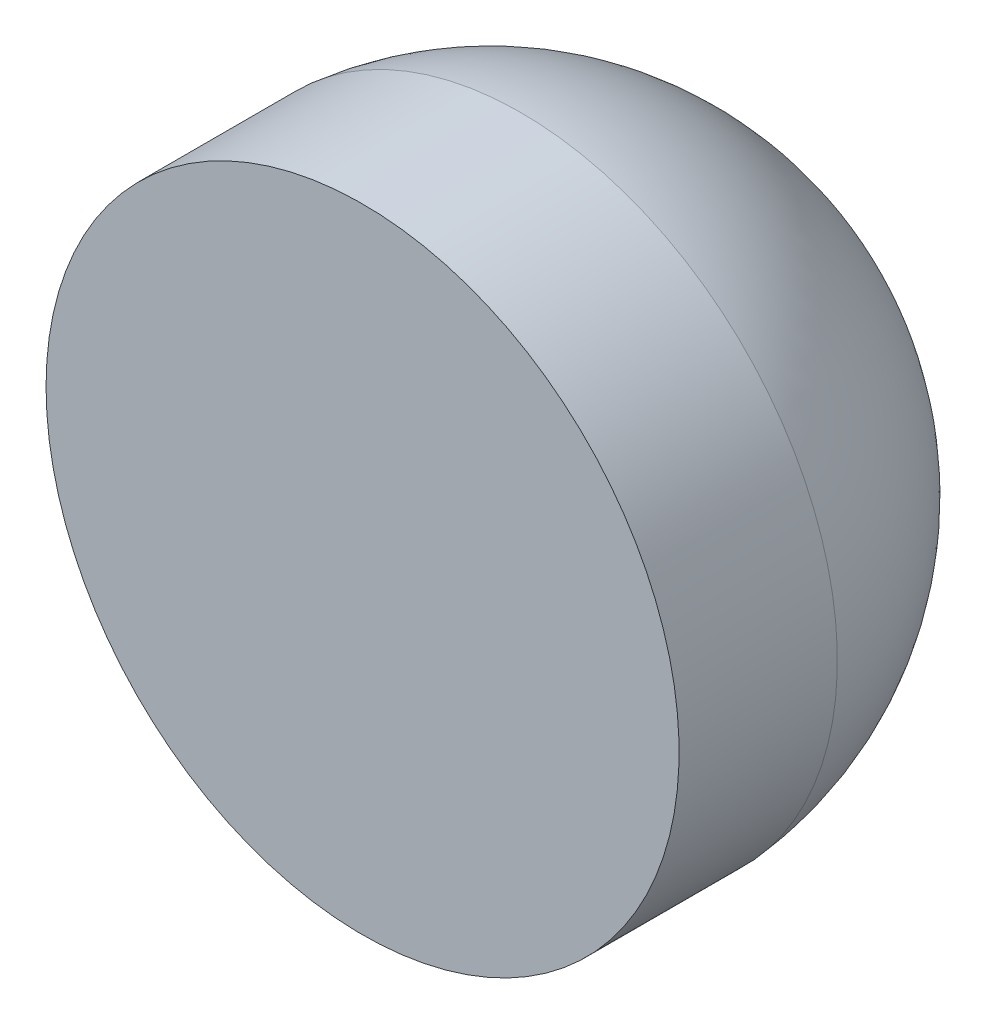
ISO-10303-21;
HEADER;
FILE_DESCRIPTION(('STEP AP214'),'2;1');
FILE_NAME('part.step','',(''),(''),'','','');
FILE_SCHEMA(('AUTOMOTIVE_DESIGN { 1 0 10303 214 1 1 1 1 }'));
ENDSEC;
DATA;
#1=APPLICATION_CONTEXT('core data for automotive mechanical design processes');
#2=APPLICATION_PROTOCOL_DEFINITION('international standard','automotive_design',2000,#1);
#3=PRODUCT_CONTEXT('',#1,'mechanical');
#4=PRODUCT('Part','Part','',(#3));
#5=PRODUCT_RELATED_PRODUCT_CATEGORY('part','',(#4));
#6=PRODUCT_DEFINITION_FORMATION('','',#4);
#7=PRODUCT_DEFINITION_CONTEXT('part definition',#1,'design');
#8=PRODUCT_DEFINITION('design','',#6,#7);
#9=PRODUCT_DEFINITION_SHAPE('','',#8);
#10=(LENGTH_UNIT() NAMED_UNIT(*) SI_UNIT(.MILLI.,.METRE.));
#11=(NAMED_UNIT(*) PLANE_ANGLE_UNIT() SI_UNIT($,.RADIAN.));
#12=(NAMED_UNIT(*) SI_UNIT($,.STERADIAN.) SOLID_ANGLE_UNIT());
#13=UNCERTAINTY_MEASURE_WITH_UNIT(LENGTH_MEASURE(1.E-05),#10,'distance_accuracy_value','');
#14=(GEOMETRIC_REPRESENTATION_CONTEXT(3) GLOBAL_UNCERTAINTY_ASSIGNED_CONTEXT((#13)) GLOBAL_UNIT_ASSIGNED_CONTEXT((#10,
#11,#12)) REPRESENTATION_CONTEXT('',''));
#15=CARTESIAN_POINT('',(0.,0.,0.));
#16=DIRECTION('',(0.,0.,1.));
#17=DIRECTION('',(1.,0.,0.));
#18=AXIS2_PLACEMENT_3D('',#15,#16,#17);
#19=CARTESIAN_POINT('',(0.,0.,-5.9));
#20=DIRECTION('',(0.,0.,1.));
#21=DIRECTION('',(1.,0.,0.));
#22=AXIS2_PLACEMENT_3D('',#19,#20,#21);
#23=PLANE('',#22);
#24=CARTESIAN_POINT('',(0.,0.,-5.9));
#25=DIRECTION('',(0.,0.,-1.));
#26=DIRECTION('',(-1.,0.,0.));
#27=AXIS2_PLACEMENT_3D('',#24,#25,#26);
#28=CIRCLE('',#27,2.5);
#29=CARTESIAN_POINT('',(-2.5,0.,-5.9));
#30=VERTEX_POINT('',#29);
#31=EDGE_CURVE('E10',#30,#30,#28,.T.);
#32=ORIENTED_EDGE('',*,*,#31,.T.);
#33=EDGE_LOOP('',(#32));
#34=FACE_BOUND('',#33,.T.);
#35=ADVANCED_FACE('F30',(#34),#23,.F.);
#36=CARTESIAN_POINT('',(0.,0.,-5.9));
#37=DIRECTION('',(0.,0.,-1.));
#38=DIRECTION('',(-1.,0.,0.));
#39=AXIS2_PLACEMENT_3D('',#36,#37,#38);
#40=CYLINDRICAL_SURFACE('',#39,2.5);
#41=ORIENTED_EDGE('',*,*,#31,.F.);
#42=EDGE_LOOP('',(#41));
#43=FACE_BOUND('',#42,.T.);
#44=CARTESIAN_POINT('',(0.,0.,-7.9));
#45=DIRECTION('',(0.,0.,-1.));
#46=DIRECTION('',(-1.,0.,0.));
#47=AXIS2_PLACEMENT_3D('',#44,#45,#46);
#48=CIRCLE('',#47,2.5);
#49=CARTESIAN_POINT('',(-2.5,0.,-7.9));
#50=VERTEX_POINT('',#49);
#51=EDGE_CURVE('E36',#50,#50,#48,.T.);
#52=ORIENTED_EDGE('',*,*,#51,.T.);
#53=EDGE_LOOP('',(#52));
#54=FACE_BOUND('',#53,.T.);
#55=ADVANCED_FACE('F62',(#43,#54),#40,.F.);
#56=CARTESIAN_POINT('',(0.,0.,-2.43343537079642));
#57=DIRECTION('',(0.,0.,-1.));
#58=DIRECTION('',(-1.,0.,0.));
#59=AXIS2_PLACEMENT_3D('',#56,#57,#58);
#60=DEGENERATE_TOROIDAL_SURFACE('',#59,0.0268095191149806,6.,.T.);
#61=ORIENTED_EDGE('',*,*,#51,.F.);
#62=EDGE_LOOP('',(#61));
#63=FACE_BOUND('',#62,.T.);
#64=CARTESIAN_POINT('',(0.,0.,-3.));
#65=DIRECTION('',(0.,0.,-1.));
#66=DIRECTION('',(-1.,0.,0.));
#67=AXIS2_PLACEMENT_3D('',#64,#65,#66);
#68=CIRCLE('',#67,6.);
#69=CARTESIAN_POINT('',(-6.,0.,-3.));
#70=VERTEX_POINT('',#69);
#71=EDGE_CURVE('E40',#70,#70,#68,.T.);
#72=ORIENTED_EDGE('',*,*,#71,.T.);
#73=EDGE_LOOP('',(#72));
#74=FACE_BOUND('',#73,.T.);
#75=ADVANCED_FACE('F58',(#63,#74),#60,.T.);
#76=CARTESIAN_POINT('',(0.,0.,-5.9));
#77=DIRECTION('',(0.,0.,-1.));
#78=DIRECTION('',(-1.,0.,0.));
#79=AXIS2_PLACEMENT_3D('',#76,#77,#78);
#80=CYLINDRICAL_SURFACE('',#79,6.);
#81=ORIENTED_EDGE('',*,*,#71,.F.);
#82=EDGE_LOOP('',(#81));
#83=FACE_BOUND('',#82,.T.);
#84=CARTESIAN_POINT('',(0.,0.,0.));
#85=DIRECTION('',(0.,0.,-1.));
#86=DIRECTION('',(-1.,0.,0.));
#87=AXIS2_PLACEMENT_3D('',#84,#85,#86);
#88=CIRCLE('',#87,6.);
#89=CARTESIAN_POINT('',(-6.,0.,0.));
#90=VERTEX_POINT('',#89);
#91=EDGE_CURVE('E44',#90,#90,#88,.T.);
#92=ORIENTED_EDGE('',*,*,#91,.T.);
#93=EDGE_LOOP('',(#92));
#94=FACE_BOUND('',#93,.T.);
#95=ADVANCED_FACE('F50',(#83,#94),#80,.T.);
#96=CARTESIAN_POINT('',(0.,0.,0.));
#97=DIRECTION('',(0.,0.,-1.));
#98=DIRECTION('',(-1.,0.,0.));
#99=AXIS2_PLACEMENT_3D('',#96,#97,#98);
#100=PLANE('',#99);
#101=ORIENTED_EDGE('',*,*,#91,.F.);
#102=EDGE_LOOP('',(#101));
#103=FACE_BOUND('',#102,.T.);
#104=ADVANCED_FACE('F52',(#103),#100,.F.);
#105=CLOSED_SHELL('',(#35,#55,#75,#95,#104));
#106=MANIFOLD_SOLID_BREP('B2',#105);
#107=ADVANCED_BREP_SHAPE_REPRESENTATION('',(#18,#106),#14);
#108=SHAPE_DEFINITION_REPRESENTATION(#9,#107);
ENDSEC;
END-ISO-10303-21;
